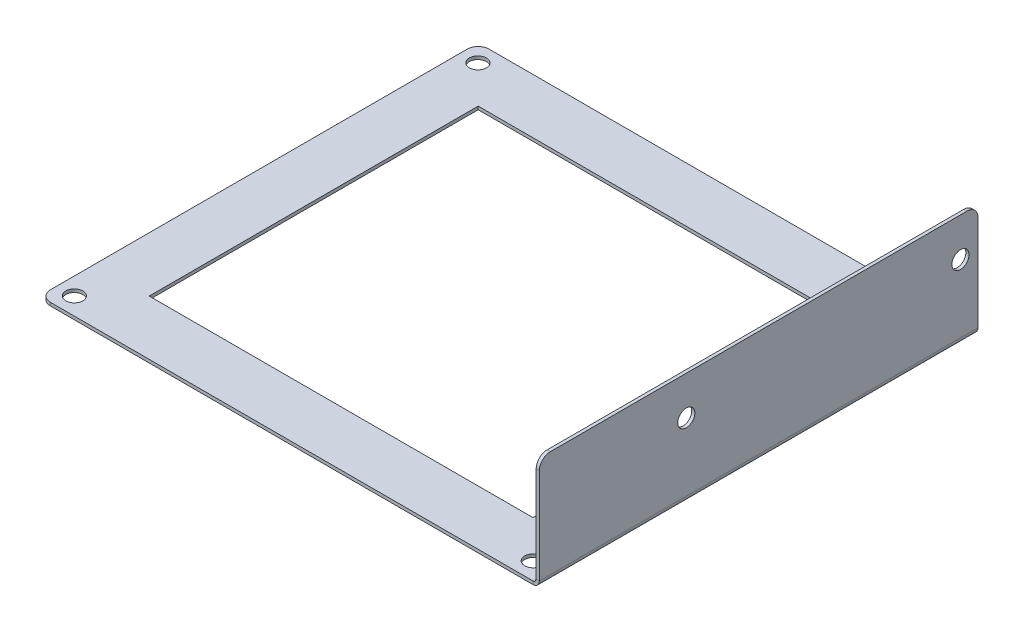
ISO-10303-21;
HEADER;
FILE_DESCRIPTION(('STEP AP214'),'2;1');
FILE_NAME('part.step','',(''),(''),'','','');
FILE_SCHEMA(('AUTOMOTIVE_DESIGN { 1 0 10303 214 1 1 1 1 }'));
ENDSEC;
DATA;
#1=APPLICATION_CONTEXT('core data for automotive mechanical design processes');
#2=APPLICATION_PROTOCOL_DEFINITION('international standard','automotive_design',2000,#1);
#3=PRODUCT_CONTEXT('',#1,'mechanical');
#4=PRODUCT('Part','Part','',(#3));
#5=PRODUCT_RELATED_PRODUCT_CATEGORY('part','',(#4));
#6=PRODUCT_DEFINITION_FORMATION('','',#4);
#7=PRODUCT_DEFINITION_CONTEXT('part definition',#1,'design');
#8=PRODUCT_DEFINITION('design','',#6,#7);
#9=PRODUCT_DEFINITION_SHAPE('','',#8);
#10=(LENGTH_UNIT() NAMED_UNIT(*) SI_UNIT(.MILLI.,.METRE.));
#11=(NAMED_UNIT(*) PLANE_ANGLE_UNIT() SI_UNIT($,.RADIAN.));
#12=(NAMED_UNIT(*) SI_UNIT($,.STERADIAN.) SOLID_ANGLE_UNIT());
#13=UNCERTAINTY_MEASURE_WITH_UNIT(LENGTH_MEASURE(1.E-05),#10,'distance_accuracy_value','');
#14=(GEOMETRIC_REPRESENTATION_CONTEXT(3) GLOBAL_UNCERTAINTY_ASSIGNED_CONTEXT((#13)) GLOBAL_UNIT_ASSIGNED_CONTEXT((#10,
#11,#12)) REPRESENTATION_CONTEXT('',''));
#15=CARTESIAN_POINT('',(0.,0.,0.));
#16=DIRECTION('',(0.,0.,1.));
#17=DIRECTION('',(1.,0.,0.));
#18=AXIS2_PLACEMENT_3D('',#15,#16,#17);
#19=CARTESIAN_POINT('',(-114.3,-0.7366,-101.6));
#20=DIRECTION('',(-1.,0.,0.));
#21=DIRECTION('',(0.,0.,1.));
#22=AXIS2_PLACEMENT_3D('',#19,#20,#21);
#23=PLANE('',#22);
#24=DIRECTION('',(0.,0.,1.));
#25=VECTOR('',#24,1.);
#26=CARTESIAN_POINT('',(-114.3,-0.7366,-101.6));
#27=LINE('',#26,#25);
#28=CARTESIAN_POINT('',(-114.3,-0.7366,-99.06));
#29=VERTEX_POINT('',#28);
#30=CARTESIAN_POINT('',(-114.3,-0.7366,-2.54));
#31=VERTEX_POINT('',#30);
#32=EDGE_CURVE('E288',#29,#31,#27,.T.);
#33=ORIENTED_EDGE('',*,*,#32,.T.);
#34=DIRECTION('',(0.,1.,0.));
#35=VECTOR('',#34,1.);
#36=CARTESIAN_POINT('',(-114.3,-0.7366,-2.54));
#37=LINE('',#36,#35);
#38=CARTESIAN_POINT('',(-114.3,0.,-2.54));
#39=VERTEX_POINT('',#38);
#40=EDGE_CURVE('E333',#31,#39,#37,.T.);
#41=ORIENTED_EDGE('',*,*,#40,.T.);
#42=DIRECTION('',(0.,0.,1.));
#43=VECTOR('',#42,1.);
#44=CARTESIAN_POINT('',(-114.3,0.,-101.6));
#45=LINE('',#44,#43);
#46=CARTESIAN_POINT('',(-114.3,0.,-99.06));
#47=VERTEX_POINT('',#46);
#48=EDGE_CURVE('E279',#47,#39,#45,.T.);
#49=ORIENTED_EDGE('',*,*,#48,.F.);
#50=DIRECTION('',(0.,1.,0.));
#51=VECTOR('',#50,1.);
#52=CARTESIAN_POINT('',(-114.3,-0.7366,-99.06));
#53=LINE('',#52,#51);
#54=EDGE_CURVE('E331',#47,#29,#53,.F.);
#55=ORIENTED_EDGE('',*,*,#54,.T.);
#56=EDGE_LOOP('',(#33,#41,#49,#55));
#57=FACE_BOUND('',#56,.T.);
#58=ADVANCED_FACE('F54',(#57),#23,.T.);
#59=CARTESIAN_POINT('',(-114.3,-0.7366,-101.6));
#60=DIRECTION('',(0.,0.,-1.));
#61=DIRECTION('',(-1.,0.,0.));
#62=AXIS2_PLACEMENT_3D('',#59,#60,#61);
#63=PLANE('',#62);
#64=DIRECTION('',(-1.,0.,0.));
#65=VECTOR('',#64,1.);
#66=CARTESIAN_POINT('',(-114.3,-0.7366,-101.6));
#67=LINE('',#66,#65);
#68=CARTESIAN_POINT('',(0.,-0.736599999999996,-101.6));
#69=VERTEX_POINT('',#68);
#70=CARTESIAN_POINT('',(-111.76,-0.7366,-101.6));
#71=VERTEX_POINT('',#70);
#72=EDGE_CURVE('E297',#69,#71,#67,.T.);
#73=ORIENTED_EDGE('',*,*,#72,.T.);
#74=DIRECTION('',(0.,1.,0.));
#75=VECTOR('',#74,1.);
#76=CARTESIAN_POINT('',(-111.76,-0.7366,-101.6));
#77=LINE('',#76,#75);
#78=CARTESIAN_POINT('',(-111.76,0.,-101.6));
#79=VERTEX_POINT('',#78);
#80=EDGE_CURVE('E13',#71,#79,#77,.T.);
#81=ORIENTED_EDGE('',*,*,#80,.T.);
#82=DIRECTION('',(-1.,0.,0.));
#83=VECTOR('',#82,1.);
#84=CARTESIAN_POINT('',(-114.3,0.,-101.6));
#85=LINE('',#84,#83);
#86=CARTESIAN_POINT('',(0.,0.,-101.6));
#87=VERTEX_POINT('',#86);
#88=EDGE_CURVE('E292',#87,#79,#85,.T.);
#89=ORIENTED_EDGE('',*,*,#88,.F.);
#90=DIRECTION('',(0.,1.,0.));
#91=VECTOR('',#90,1.);
#92=CARTESIAN_POINT('',(0.,-0.7366,-101.6));
#93=LINE('',#92,#91);
#94=EDGE_CURVE('E308',#69,#87,#93,.T.);
#95=ORIENTED_EDGE('',*,*,#94,.F.);
#96=EDGE_LOOP('',(#73,#81,#89,#95));
#97=FACE_BOUND('',#96,.T.);
#98=ADVANCED_FACE('F406',(#97),#63,.T.);
#99=CARTESIAN_POINT('',(-114.3,-0.7366,0.));
#100=DIRECTION('',(0.,0.,1.));
#101=DIRECTION('',(1.,0.,0.));
#102=AXIS2_PLACEMENT_3D('',#99,#100,#101);
#103=PLANE('',#102);
#104=DIRECTION('',(1.,0.,0.));
#105=VECTOR('',#104,1.);
#106=CARTESIAN_POINT('',(-114.3,0.,0.));
#107=LINE('',#106,#105);
#108=CARTESIAN_POINT('',(-111.76,0.,0.));
#109=VERTEX_POINT('',#108);
#110=CARTESIAN_POINT('',(0.,0.,0.));
#111=VERTEX_POINT('',#110);
#112=EDGE_CURVE('E302',#109,#111,#107,.T.);
#113=ORIENTED_EDGE('',*,*,#112,.F.);
#114=DIRECTION('',(0.,1.,0.));
#115=VECTOR('',#114,1.);
#116=CARTESIAN_POINT('',(-111.76,-0.7366,0.));
#117=LINE('',#116,#115);
#118=CARTESIAN_POINT('',(-111.76,-0.7366,0.));
#119=VERTEX_POINT('',#118);
#120=EDGE_CURVE('E77',#109,#119,#117,.F.);
#121=ORIENTED_EDGE('',*,*,#120,.T.);
#122=DIRECTION('',(1.,0.,0.));
#123=VECTOR('',#122,1.);
#124=CARTESIAN_POINT('',(-114.3,-0.7366,0.));
#125=LINE('',#124,#123);
#126=CARTESIAN_POINT('',(0.,-0.7366,0.));
#127=VERTEX_POINT('',#126);
#128=EDGE_CURVE('E291',#119,#127,#125,.T.);
#129=ORIENTED_EDGE('',*,*,#128,.T.);
#130=DIRECTION('',(0.,1.,0.));
#131=VECTOR('',#130,1.);
#132=CARTESIAN_POINT('',(0.,-0.7366,0.));
#133=LINE('',#132,#131);
#134=EDGE_CURVE('E299',#127,#111,#133,.T.);
#135=ORIENTED_EDGE('',*,*,#134,.T.);
#136=EDGE_LOOP('',(#113,#121,#129,#135));
#137=FACE_BOUND('',#136,.T.);
#138=ADVANCED_FACE('F351',(#137),#103,.T.);
#139=CARTESIAN_POINT('',(0.,-0.7366,0.));
#140=DIRECTION('',(0.,1.,0.));
#141=DIRECTION('',(0.,0.,1.));
#142=AXIS2_PLACEMENT_3D('',#139,#140,#141);
#143=PLANE('',#142);
#144=DIRECTION('',(1.,0.,0.));
#145=VECTOR('',#144,1.);
#146=CARTESIAN_POINT('',(-12.7,-0.7366,-12.7));
#147=LINE('',#146,#145);
#148=CARTESIAN_POINT('',(-101.6,-0.7366,-12.7));
#149=VERTEX_POINT('',#148);
#150=CARTESIAN_POINT('',(-12.7,-0.7366,-12.7));
#151=VERTEX_POINT('',#150);
#152=EDGE_CURVE('E181',#149,#151,#147,.T.);
#153=ORIENTED_EDGE('',*,*,#152,.T.);
#154=DIRECTION('',(0.,0.,-1.));
#155=VECTOR('',#154,1.);
#156=CARTESIAN_POINT('',(-12.7,-0.7366,-12.7));
#157=LINE('',#156,#155);
#158=CARTESIAN_POINT('',(-12.7,-0.7366,-88.9));
#159=VERTEX_POINT('',#158);
#160=EDGE_CURVE('E173',#151,#159,#157,.T.);
#161=ORIENTED_EDGE('',*,*,#160,.T.);
#162=DIRECTION('',(-1.,0.,0.));
#163=VECTOR('',#162,1.);
#164=CARTESIAN_POINT('',(-12.7,-0.7366,-88.9));
#165=LINE('',#164,#163);
#166=CARTESIAN_POINT('',(-101.6,-0.7366,-88.9));
#167=VERTEX_POINT('',#166);
#168=EDGE_CURVE('E185',#159,#167,#165,.T.);
#169=ORIENTED_EDGE('',*,*,#168,.T.);
#170=DIRECTION('',(0.,0.,1.));
#171=VECTOR('',#170,1.);
#172=CARTESIAN_POINT('',(-101.6,-0.7366,-12.7));
#173=LINE('',#172,#171);
#174=EDGE_CURVE('E189',#167,#149,#173,.T.);
#175=ORIENTED_EDGE('',*,*,#174,.T.);
#176=EDGE_LOOP('',(#153,#161,#169,#175));
#177=FACE_BOUND('',#176,.T.);
#178=CARTESIAN_POINT('',(-110.2995,-0.7366,-4.06400000000001));
#179=DIRECTION('',(0.,1.,0.));
#180=DIRECTION('',(0.,0.,1.));
#181=AXIS2_PLACEMENT_3D('',#178,#179,#180);
#182=CIRCLE('',#181,1.984375);
#183=CARTESIAN_POINT('',(-110.2995,-0.7366,-2.07962500000002));
#184=VERTEX_POINT('',#183);
#185=EDGE_CURVE('E227',#184,#184,#182,.T.);
#186=ORIENTED_EDGE('',*,*,#185,.T.);
#187=EDGE_LOOP('',(#186));
#188=FACE_BOUND('',#187,.T.);
#189=CARTESIAN_POINT('',(-110.2995,-0.7366,-97.536));
#190=DIRECTION('',(0.,1.,0.));
#191=DIRECTION('',(0.,0.,1.));
#192=AXIS2_PLACEMENT_3D('',#189,#190,#191);
#193=CIRCLE('',#192,1.984375);
#194=CARTESIAN_POINT('',(-110.2995,-0.7366,-95.551625));
#195=VERTEX_POINT('',#194);
#196=EDGE_CURVE('E233',#195,#195,#193,.T.);
#197=ORIENTED_EDGE('',*,*,#196,.T.);
#198=EDGE_LOOP('',(#197));
#199=FACE_BOUND('',#198,.T.);
#200=CARTESIAN_POINT('',(-4.00050000000001,-0.7366,-97.536));
#201=DIRECTION('',(0.,1.,0.));
#202=DIRECTION('',(0.,0.,1.));
#203=AXIS2_PLACEMENT_3D('',#200,#201,#202);
#204=CIRCLE('',#203,1.984375);
#205=CARTESIAN_POINT('',(-4.00050000000001,-0.7366,-95.551625));
#206=VERTEX_POINT('',#205);
#207=EDGE_CURVE('E239',#206,#206,#204,.T.);
#208=ORIENTED_EDGE('',*,*,#207,.T.);
#209=EDGE_LOOP('',(#208));
#210=FACE_BOUND('',#209,.T.);
#211=CARTESIAN_POINT('',(-4.00050000000001,-0.7366,-4.06400000000001));
#212=DIRECTION('',(0.,1.,0.));
#213=DIRECTION('',(0.,0.,1.));
#214=AXIS2_PLACEMENT_3D('',#211,#212,#213);
#215=CIRCLE('',#214,1.984375);
#216=CARTESIAN_POINT('',(-4.00050000000001,-0.7366,-2.07962500000001));
#217=VERTEX_POINT('',#216);
#218=EDGE_CURVE('E245',#217,#217,#215,.T.);
#219=ORIENTED_EDGE('',*,*,#218,.T.);
#220=EDGE_LOOP('',(#219));
#221=FACE_BOUND('',#220,.T.);
#222=ORIENTED_EDGE('',*,*,#128,.F.);
#223=CARTESIAN_POINT('',(-111.76,-0.7366,-2.54));
#224=DIRECTION('',(0.,1.,0.));
#225=DIRECTION('',(0.,0.,1.));
#226=AXIS2_PLACEMENT_3D('',#223,#224,#225);
#227=CIRCLE('',#226,2.54);
#228=EDGE_CURVE('E62',#119,#31,#227,.F.);
#229=ORIENTED_EDGE('',*,*,#228,.T.);
#230=ORIENTED_EDGE('',*,*,#32,.F.);
#231=CARTESIAN_POINT('',(-111.76,-0.7366,-99.06));
#232=DIRECTION('',(0.,1.,0.));
#233=DIRECTION('',(0.,0.,1.));
#234=AXIS2_PLACEMENT_3D('',#231,#232,#233);
#235=CIRCLE('',#234,2.54);
#236=EDGE_CURVE('E69',#29,#71,#235,.F.);
#237=ORIENTED_EDGE('',*,*,#236,.T.);
#238=ORIENTED_EDGE('',*,*,#72,.F.);
#239=DIRECTION('',(0.,0.,-1.));
#240=VECTOR('',#239,1.);
#241=CARTESIAN_POINT('',(0.,-0.7366,-101.6));
#242=LINE('',#241,#240);
#243=EDGE_CURVE('E294',#127,#69,#242,.T.);
#244=ORIENTED_EDGE('',*,*,#243,.F.);
#245=EDGE_LOOP('',(#222,#229,#230,#237,#238,#244));
#246=FACE_BOUND('',#245,.T.);
#247=ADVANCED_FACE('F191',(#177,#188,#199,#210,#221,#246),#143,.F.);
#248=CARTESIAN_POINT('',(0.,0.,0.));
#249=DIRECTION('',(0.,1.,0.));
#250=DIRECTION('',(0.,0.,1.));
#251=AXIS2_PLACEMENT_3D('',#248,#249,#250);
#252=PLANE('',#251);
#253=DIRECTION('',(0.,0.,-1.));
#254=VECTOR('',#253,1.);
#255=CARTESIAN_POINT('',(-12.7,0.,-12.7));
#256=LINE('',#255,#254);
#257=CARTESIAN_POINT('',(-12.7,0.,-12.7));
#258=VERTEX_POINT('',#257);
#259=CARTESIAN_POINT('',(-12.7,0.,-88.9));
#260=VERTEX_POINT('',#259);
#261=EDGE_CURVE('E176',#258,#260,#256,.T.);
#262=ORIENTED_EDGE('',*,*,#261,.F.);
#263=DIRECTION('',(1.,0.,0.));
#264=VECTOR('',#263,1.);
#265=CARTESIAN_POINT('',(-12.7,0.,-12.7));
#266=LINE('',#265,#264);
#267=CARTESIAN_POINT('',(-101.6,0.,-12.7));
#268=VERTEX_POINT('',#267);
#269=EDGE_CURVE('E194',#268,#258,#266,.T.);
#270=ORIENTED_EDGE('',*,*,#269,.F.);
#271=DIRECTION('',(0.,0.,1.));
#272=VECTOR('',#271,1.);
#273=CARTESIAN_POINT('',(-101.6,0.,-12.7));
#274=LINE('',#273,#272);
#275=CARTESIAN_POINT('',(-101.6,0.,-88.9));
#276=VERTEX_POINT('',#275);
#277=EDGE_CURVE('E197',#276,#268,#274,.T.);
#278=ORIENTED_EDGE('',*,*,#277,.F.);
#279=DIRECTION('',(-1.,0.,0.));
#280=VECTOR('',#279,1.);
#281=CARTESIAN_POINT('',(-12.7,0.,-88.9));
#282=LINE('',#281,#280);
#283=EDGE_CURVE('E203',#260,#276,#282,.T.);
#284=ORIENTED_EDGE('',*,*,#283,.F.);
#285=EDGE_LOOP('',(#262,#270,#278,#284));
#286=FACE_BOUND('',#285,.T.);
#287=CARTESIAN_POINT('',(-110.2995,0.,-4.06400000000001));
#288=DIRECTION('',(0.,1.,0.));
#289=DIRECTION('',(0.,0.,1.));
#290=AXIS2_PLACEMENT_3D('',#287,#288,#289);
#291=CIRCLE('',#290,1.98437499999998);
#292=CARTESIAN_POINT('',(-110.2995,0.,-2.07962500000003));
#293=VERTEX_POINT('',#292);
#294=EDGE_CURVE('E224',#293,#293,#291,.T.);
#295=ORIENTED_EDGE('',*,*,#294,.F.);
#296=EDGE_LOOP('',(#295));
#297=FACE_BOUND('',#296,.T.);
#298=CARTESIAN_POINT('',(-110.2995,0.,-97.536));
#299=DIRECTION('',(0.,1.,0.));
#300=DIRECTION('',(0.,0.,1.));
#301=AXIS2_PLACEMENT_3D('',#298,#299,#300);
#302=CIRCLE('',#301,1.98437499999998);
#303=CARTESIAN_POINT('',(-110.2995,0.,-95.551625));
#304=VERTEX_POINT('',#303);
#305=EDGE_CURVE('E230',#304,#304,#302,.T.);
#306=ORIENTED_EDGE('',*,*,#305,.F.);
#307=EDGE_LOOP('',(#306));
#308=FACE_BOUND('',#307,.T.);
#309=CARTESIAN_POINT('',(-4.00050000000001,0.,-97.536));
#310=DIRECTION('',(0.,1.,0.));
#311=DIRECTION('',(0.,0.,1.));
#312=AXIS2_PLACEMENT_3D('',#309,#310,#311);
#313=CIRCLE('',#312,1.98437499999999);
#314=CARTESIAN_POINT('',(-4.00050000000001,0.,-95.551625));
#315=VERTEX_POINT('',#314);
#316=EDGE_CURVE('E236',#315,#315,#313,.T.);
#317=ORIENTED_EDGE('',*,*,#316,.F.);
#318=EDGE_LOOP('',(#317));
#319=FACE_BOUND('',#318,.T.);
#320=CARTESIAN_POINT('',(-4.00050000000001,0.,-4.06400000000001));
#321=DIRECTION('',(0.,1.,0.));
#322=DIRECTION('',(0.,0.,1.));
#323=AXIS2_PLACEMENT_3D('',#320,#321,#322);
#324=CIRCLE('',#323,1.98437499999999);
#325=CARTESIAN_POINT('',(-4.00050000000001,0.,-2.07962500000002));
#326=VERTEX_POINT('',#325);
#327=EDGE_CURVE('E242',#326,#326,#324,.T.);
#328=ORIENTED_EDGE('',*,*,#327,.F.);
#329=EDGE_LOOP('',(#328));
#330=FACE_BOUND('',#329,.T.);
#331=ORIENTED_EDGE('',*,*,#48,.T.);
#332=CARTESIAN_POINT('',(-111.76,0.,-2.54));
#333=DIRECTION('',(0.,1.,0.));
#334=DIRECTION('',(0.,0.,1.));
#335=AXIS2_PLACEMENT_3D('',#332,#333,#334);
#336=CIRCLE('',#335,2.54);
#337=EDGE_CURVE('E338',#39,#109,#336,.T.);
#338=ORIENTED_EDGE('',*,*,#337,.T.);
#339=ORIENTED_EDGE('',*,*,#112,.T.);
#340=DIRECTION('',(0.,0.,-1.));
#341=VECTOR('',#340,1.);
#342=CARTESIAN_POINT('',(0.,0.,-101.6));
#343=LINE('',#342,#341);
#344=EDGE_CURVE('E304',#111,#87,#343,.T.);
#345=ORIENTED_EDGE('',*,*,#344,.T.);
#346=ORIENTED_EDGE('',*,*,#88,.T.);
#347=CARTESIAN_POINT('',(-111.76,0.,-99.06));
#348=DIRECTION('',(0.,1.,0.));
#349=DIRECTION('',(0.,0.,1.));
#350=AXIS2_PLACEMENT_3D('',#347,#348,#349);
#351=CIRCLE('',#350,2.54);
#352=EDGE_CURVE('E336',#79,#47,#351,.T.);
#353=ORIENTED_EDGE('',*,*,#352,.T.);
#354=EDGE_LOOP('',(#331,#338,#339,#345,#346,#353));
#355=FACE_BOUND('',#354,.T.);
#356=ADVANCED_FACE('F350',(#286,#297,#308,#319,#330,#355),#252,.T.);
#357=CARTESIAN_POINT('',(0.,0.7366,0.));
#358=DIRECTION('',(0.,0.,1.));
#359=DIRECTION('',(1.,0.,0.));
#360=AXIS2_PLACEMENT_3D('',#357,#358,#359);
#361=PLANE('',#360);
#362=DIRECTION('',(-1.,0.,0.));
#363=VECTOR('',#362,1.);
#364=CARTESIAN_POINT('',(1.4732,0.736599999999995,0.));
#365=LINE('',#364,#363);
#366=CARTESIAN_POINT('',(0.7366,0.736599999999997,0.));
#367=VERTEX_POINT('',#366);
#368=CARTESIAN_POINT('',(1.4732,0.736599999999995,0.));
#369=VERTEX_POINT('',#368);
#370=EDGE_CURVE('E248',#367,#369,#365,.F.);
#371=ORIENTED_EDGE('',*,*,#370,.F.);
#372=CARTESIAN_POINT('',(0.,0.7366,0.));
#373=DIRECTION('',(0.,0.,-1.));
#374=DIRECTION('',(-1.,0.,0.));
#375=AXIS2_PLACEMENT_3D('',#372,#373,#374);
#376=CIRCLE('',#375,0.736599999999996);
#377=EDGE_CURVE('E283',#111,#367,#376,.F.);
#378=ORIENTED_EDGE('',*,*,#377,.F.);
#379=ORIENTED_EDGE('',*,*,#134,.F.);
#380=CARTESIAN_POINT('',(0.,0.7366,0.));
#381=DIRECTION('',(0.,0.,-1.));
#382=DIRECTION('',(-1.,0.,0.));
#383=AXIS2_PLACEMENT_3D('',#380,#381,#382);
#384=CIRCLE('',#383,1.4732);
#385=EDGE_CURVE('E276',#127,#369,#384,.F.);
#386=ORIENTED_EDGE('',*,*,#385,.T.);
#387=EDGE_LOOP('',(#371,#378,#379,#386));
#388=FACE_BOUND('',#387,.T.);
#389=ADVANCED_FACE('F363',(#388),#361,.T.);
#390=CARTESIAN_POINT('',(0.,0.7366,-101.6));
#391=DIRECTION('',(0.,0.,1.));
#392=DIRECTION('',(1.,0.,0.));
#393=AXIS2_PLACEMENT_3D('',#390,#391,#392);
#394=PLANE('',#393);
#395=CARTESIAN_POINT('',(0.,0.7366,-101.6));
#396=DIRECTION('',(0.,0.,-1.));
#397=DIRECTION('',(-1.,0.,0.));
#398=AXIS2_PLACEMENT_3D('',#395,#396,#397);
#399=CIRCLE('',#398,0.736599999999996);
#400=CARTESIAN_POINT('',(0.736599999999992,0.736599999999997,-101.6));
#401=VERTEX_POINT('',#400);
#402=EDGE_CURVE('E251',#401,#87,#399,.T.);
#403=ORIENTED_EDGE('',*,*,#402,.F.);
#404=DIRECTION('',(-1.,0.,0.));
#405=VECTOR('',#404,1.);
#406=CARTESIAN_POINT('',(0.7366,0.736599999999997,-101.6));
#407=LINE('',#406,#405);
#408=CARTESIAN_POINT('',(1.4732,0.736599999999995,-101.6));
#409=VERTEX_POINT('',#408);
#410=EDGE_CURVE('E269',#401,#409,#407,.F.);
#411=ORIENTED_EDGE('',*,*,#410,.T.);
#412=CARTESIAN_POINT('',(0.,0.7366,-101.6));
#413=DIRECTION('',(0.,0.,-1.));
#414=DIRECTION('',(-1.,0.,0.));
#415=AXIS2_PLACEMENT_3D('',#412,#413,#414);
#416=CIRCLE('',#415,1.4732);
#417=EDGE_CURVE('E280',#409,#69,#416,.T.);
#418=ORIENTED_EDGE('',*,*,#417,.T.);
#419=ORIENTED_EDGE('',*,*,#94,.T.);
#420=EDGE_LOOP('',(#403,#411,#418,#419));
#421=FACE_BOUND('',#420,.T.);
#422=ADVANCED_FACE('F375',(#421),#394,.F.);
#423=CARTESIAN_POINT('',(0.,0.7366,-101.6));
#424=DIRECTION('',(0.,0.,-1.));
#425=DIRECTION('',(1.,0.,0.));
#426=AXIS2_PLACEMENT_3D('',#423,#424,#425);
#427=CYLINDRICAL_SURFACE('',#426,1.4732);
#428=ORIENTED_EDGE('',*,*,#243,.T.);
#429=ORIENTED_EDGE('',*,*,#417,.F.);
#430=DIRECTION('',(0.,0.,-1.));
#431=VECTOR('',#430,1.);
#432=CARTESIAN_POINT('',(1.4732,0.736599999999995,0.));
#433=LINE('',#432,#431);
#434=EDGE_CURVE('E266',#409,#369,#433,.F.);
#435=ORIENTED_EDGE('',*,*,#434,.T.);
#436=ORIENTED_EDGE('',*,*,#385,.F.);
#437=EDGE_LOOP('',(#428,#429,#435,#436));
#438=FACE_BOUND('',#437,.T.);
#439=ADVANCED_FACE('F422',(#438),#427,.T.);
#440=CARTESIAN_POINT('',(0.,0.7366,-101.6));
#441=DIRECTION('',(0.,0.,-1.));
#442=DIRECTION('',(1.,0.,0.));
#443=AXIS2_PLACEMENT_3D('',#440,#441,#442);
#444=CYLINDRICAL_SURFACE('',#443,0.736599999999996);
#445=ORIENTED_EDGE('',*,*,#344,.F.);
#446=ORIENTED_EDGE('',*,*,#377,.T.);
#447=DIRECTION('',(0.,0.,-1.));
#448=VECTOR('',#447,1.);
#449=CARTESIAN_POINT('',(0.7366,0.736599999999997,0.));
#450=LINE('',#449,#448);
#451=EDGE_CURVE('E272',#367,#401,#450,.T.);
#452=ORIENTED_EDGE('',*,*,#451,.T.);
#453=ORIENTED_EDGE('',*,*,#402,.T.);
#454=EDGE_LOOP('',(#445,#446,#452,#453));
#455=FACE_BOUND('',#454,.T.);
#456=ADVANCED_FACE('F358',(#455),#444,.F.);
#457=CARTESIAN_POINT('',(1.47320000000009,25.4,-101.6));
#458=DIRECTION('',(0.,0.,1.));
#459=DIRECTION('',(1.,0.,0.));
#460=AXIS2_PLACEMENT_3D('',#457,#458,#459);
#461=PLANE('',#460);
#462=DIRECTION('',(0.,-1.,0.));
#463=VECTOR('',#462,1.);
#464=CARTESIAN_POINT('',(0.736600000000086,25.4,-101.6));
#465=LINE('',#464,#463);
#466=CARTESIAN_POINT('',(0.736600000000077,22.86,-101.6));
#467=VERTEX_POINT('',#466);
#468=EDGE_CURVE('E263',#401,#467,#465,.F.);
#469=ORIENTED_EDGE('',*,*,#468,.T.);
#470=DIRECTION('',(-1.,0.,0.));
#471=VECTOR('',#470,1.);
#472=CARTESIAN_POINT('',(1.47320000000008,22.86,-101.6));
#473=LINE('',#472,#471);
#474=CARTESIAN_POINT('',(1.47320000000008,22.86,-101.6));
#475=VERTEX_POINT('',#474);
#476=EDGE_CURVE('E329',#467,#475,#473,.F.);
#477=ORIENTED_EDGE('',*,*,#476,.T.);
#478=DIRECTION('',(0.,1.,0.));
#479=VECTOR('',#478,1.);
#480=CARTESIAN_POINT('',(1.4732,0.,-101.6));
#481=LINE('',#480,#479);
#482=EDGE_CURVE('E255',#409,#475,#481,.T.);
#483=ORIENTED_EDGE('',*,*,#482,.F.);
#484=ORIENTED_EDGE('',*,*,#410,.F.);
#485=EDGE_LOOP('',(#469,#477,#483,#484));
#486=FACE_BOUND('',#485,.T.);
#487=ADVANCED_FACE('F380',(#486),#461,.F.);
#488=CARTESIAN_POINT('',(1.4732,0.,0.));
#489=DIRECTION('',(0.,0.,-1.));
#490=DIRECTION('',(0.,1.,0.));
#491=AXIS2_PLACEMENT_3D('',#488,#489,#490);
#492=PLANE('',#491);
#493=DIRECTION('',(0.,-1.,0.));
#494=VECTOR('',#493,1.);
#495=CARTESIAN_POINT('',(1.4732,0.,0.));
#496=LINE('',#495,#494);
#497=CARTESIAN_POINT('',(1.47320000000008,22.86,0.));
#498=VERTEX_POINT('',#497);
#499=EDGE_CURVE('E249',#498,#369,#496,.T.);
#500=ORIENTED_EDGE('',*,*,#499,.F.);
#501=DIRECTION('',(-1.,0.,0.));
#502=VECTOR('',#501,1.);
#503=CARTESIAN_POINT('',(1.47320000000008,22.86,0.));
#504=LINE('',#503,#502);
#505=CARTESIAN_POINT('',(0.736600000000077,22.86,0.));
#506=VERTEX_POINT('',#505);
#507=EDGE_CURVE('E311',#498,#506,#504,.T.);
#508=ORIENTED_EDGE('',*,*,#507,.T.);
#509=DIRECTION('',(0.,1.,0.));
#510=VECTOR('',#509,1.);
#511=CARTESIAN_POINT('',(0.736599999999997,0.,0.));
#512=LINE('',#511,#510);
#513=EDGE_CURVE('E258',#506,#367,#512,.F.);
#514=ORIENTED_EDGE('',*,*,#513,.T.);
#515=ORIENTED_EDGE('',*,*,#370,.T.);
#516=EDGE_LOOP('',(#500,#508,#514,#515));
#517=FACE_BOUND('',#516,.T.);
#518=ADVANCED_FACE('F366',(#517),#492,.F.);
#519=CARTESIAN_POINT('',(1.4732,0.,0.));
#520=DIRECTION('',(-1.,0.,0.));
#521=DIRECTION('',(0.,-1.,0.));
#522=AXIS2_PLACEMENT_3D('',#519,#520,#521);
#523=PLANE('',#522);
#524=CARTESIAN_POINT('',(1.4732000000001,16.4360618686601,-34.036));
#525=DIRECTION('',(-1.,0.,0.));
#526=DIRECTION('',(0.,0.,1.));
#527=AXIS2_PLACEMENT_3D('',#524,#525,#526);
#528=CIRCLE('',#527,1.984375);
#529=CARTESIAN_POINT('',(1.4732000000001,16.4360618686601,-32.051625));
#530=VERTEX_POINT('',#529);
#531=EDGE_CURVE('E215',#530,#530,#528,.T.);
#532=ORIENTED_EDGE('',*,*,#531,.T.);
#533=EDGE_LOOP('',(#532));
#534=FACE_BOUND('',#533,.T.);
#535=CARTESIAN_POINT('',(1.4732000000001,16.4360618686601,-97.536));
#536=DIRECTION('',(-1.,0.,0.));
#537=DIRECTION('',(0.,0.,1.));
#538=AXIS2_PLACEMENT_3D('',#535,#536,#537);
#539=CIRCLE('',#538,1.984375);
#540=CARTESIAN_POINT('',(1.4732000000001,16.4360618686601,-95.551625));
#541=VERTEX_POINT('',#540);
#542=EDGE_CURVE('E221',#541,#541,#539,.T.);
#543=ORIENTED_EDGE('',*,*,#542,.T.);
#544=EDGE_LOOP('',(#543));
#545=FACE_BOUND('',#544,.T.);
#546=DIRECTION('',(0.,0.,1.));
#547=VECTOR('',#546,1.);
#548=CARTESIAN_POINT('',(1.47320000000009,25.4,0.));
#549=LINE('',#548,#547);
#550=CARTESIAN_POINT('',(1.47320000000009,25.4,-99.06));
#551=VERTEX_POINT('',#550);
#552=CARTESIAN_POINT('',(1.47320000000009,25.4,-2.54));
#553=VERTEX_POINT('',#552);
#554=EDGE_CURVE('E252',#551,#553,#549,.T.);
#555=ORIENTED_EDGE('',*,*,#554,.T.);
#556=CARTESIAN_POINT('',(1.47320000000008,22.86,-2.54));
#557=DIRECTION('',(-1.,0.,0.));
#558=DIRECTION('',(0.,-1.,0.));
#559=AXIS2_PLACEMENT_3D('',#556,#557,#558);
#560=CIRCLE('',#559,2.54);
#561=EDGE_CURVE('E327',#553,#498,#560,.F.);
#562=ORIENTED_EDGE('',*,*,#561,.T.);
#563=ORIENTED_EDGE('',*,*,#499,.T.);
#564=ORIENTED_EDGE('',*,*,#434,.F.);
#565=ORIENTED_EDGE('',*,*,#482,.T.);
#566=CARTESIAN_POINT('',(1.47320000000008,22.86,-99.06));
#567=DIRECTION('',(-1.,0.,0.));
#568=DIRECTION('',(0.,-1.,0.));
#569=AXIS2_PLACEMENT_3D('',#566,#567,#568);
#570=CIRCLE('',#569,2.54);
#571=EDGE_CURVE('E325',#475,#551,#570,.F.);
#572=ORIENTED_EDGE('',*,*,#571,.T.);
#573=EDGE_LOOP('',(#555,#562,#563,#564,#565,#572));
#574=FACE_BOUND('',#573,.T.);
#575=ADVANCED_FACE('F384',(#534,#545,#574),#523,.F.);
#576=CARTESIAN_POINT('',(0.736599999999997,0.,0.));
#577=DIRECTION('',(-1.,0.,0.));
#578=DIRECTION('',(0.,-1.,0.));
#579=AXIS2_PLACEMENT_3D('',#576,#577,#578);
#580=PLANE('',#579);
#581=CARTESIAN_POINT('',(0.736600000000053,16.4360618686601,-34.036));
#582=DIRECTION('',(-1.,0.,0.));
#583=DIRECTION('',(0.,0.,1.));
#584=AXIS2_PLACEMENT_3D('',#581,#582,#583);
#585=CIRCLE('',#584,1.98437499999999);
#586=CARTESIAN_POINT('',(0.736600000000053,16.4360618686601,-32.051625));
#587=VERTEX_POINT('',#586);
#588=EDGE_CURVE('E209',#587,#587,#585,.T.);
#589=ORIENTED_EDGE('',*,*,#588,.F.);
#590=EDGE_LOOP('',(#589));
#591=FACE_BOUND('',#590,.T.);
#592=CARTESIAN_POINT('',(0.736600000000053,16.4360618686601,-97.536));
#593=DIRECTION('',(-1.,0.,0.));
#594=DIRECTION('',(0.,0.,1.));
#595=AXIS2_PLACEMENT_3D('',#592,#593,#594);
#596=CIRCLE('',#595,1.98437499999999);
#597=CARTESIAN_POINT('',(0.736600000000053,16.4360618686601,-95.551625));
#598=VERTEX_POINT('',#597);
#599=EDGE_CURVE('E218',#598,#598,#596,.T.);
#600=ORIENTED_EDGE('',*,*,#599,.F.);
#601=EDGE_LOOP('',(#600));
#602=FACE_BOUND('',#601,.T.);
#603=ORIENTED_EDGE('',*,*,#513,.F.);
#604=CARTESIAN_POINT('',(0.736600000000077,22.86,-2.54));
#605=DIRECTION('',(-1.,0.,0.));
#606=DIRECTION('',(0.,-1.,0.));
#607=AXIS2_PLACEMENT_3D('',#604,#605,#606);
#608=CIRCLE('',#607,2.54);
#609=CARTESIAN_POINT('',(0.736600000000086,25.4,-2.54));
#610=VERTEX_POINT('',#609);
#611=EDGE_CURVE('E318',#506,#610,#608,.T.);
#612=ORIENTED_EDGE('',*,*,#611,.T.);
#613=DIRECTION('',(0.,0.,-1.));
#614=VECTOR('',#613,1.);
#615=CARTESIAN_POINT('',(0.736600000000086,25.4,0.));
#616=LINE('',#615,#614);
#617=CARTESIAN_POINT('',(0.736600000000086,25.4,-99.06));
#618=VERTEX_POINT('',#617);
#619=EDGE_CURVE('E260',#618,#610,#616,.F.);
#620=ORIENTED_EDGE('',*,*,#619,.F.);
#621=CARTESIAN_POINT('',(0.736600000000077,22.86,-99.06));
#622=DIRECTION('',(-1.,0.,0.));
#623=DIRECTION('',(0.,-1.,0.));
#624=AXIS2_PLACEMENT_3D('',#621,#622,#623);
#625=CIRCLE('',#624,2.54);
#626=EDGE_CURVE('E316',#618,#467,#625,.T.);
#627=ORIENTED_EDGE('',*,*,#626,.T.);
#628=ORIENTED_EDGE('',*,*,#468,.F.);
#629=ORIENTED_EDGE('',*,*,#451,.F.);
#630=EDGE_LOOP('',(#603,#612,#620,#627,#628,#629));
#631=FACE_BOUND('',#630,.T.);
#632=ADVANCED_FACE('F370',(#591,#602,#631),#580,.T.);
#633=CARTESIAN_POINT('',(1.47320000000009,25.4,0.));
#634=DIRECTION('',(0.,-1.,0.));
#635=DIRECTION('',(1.,0.,0.));
#636=AXIS2_PLACEMENT_3D('',#633,#634,#635);
#637=PLANE('',#636);
#638=ORIENTED_EDGE('',*,*,#619,.T.);
#639=DIRECTION('',(-1.,0.,0.));
#640=VECTOR('',#639,1.);
#641=CARTESIAN_POINT('',(1.47320000000009,25.4,-2.54));
#642=LINE('',#641,#640);
#643=EDGE_CURVE('E323',#610,#553,#642,.F.);
#644=ORIENTED_EDGE('',*,*,#643,.T.);
#645=ORIENTED_EDGE('',*,*,#554,.F.);
#646=DIRECTION('',(-1.,0.,0.));
#647=VECTOR('',#646,1.);
#648=CARTESIAN_POINT('',(1.47320000000009,25.4,-99.06));
#649=LINE('',#648,#647);
#650=EDGE_CURVE('E320',#551,#618,#649,.T.);
#651=ORIENTED_EDGE('',*,*,#650,.T.);
#652=EDGE_LOOP('',(#638,#644,#645,#651));
#653=FACE_BOUND('',#652,.T.);
#654=ADVANCED_FACE('F390',(#653),#637,.F.);
#655=CARTESIAN_POINT('',(-4.00050000000001,0.,-4.06400000000001));
#656=DIRECTION('',(0.,1.,0.));
#657=DIRECTION('',(0.,0.,1.));
#658=AXIS2_PLACEMENT_3D('',#655,#656,#657);
#659=CYLINDRICAL_SURFACE('',#658,1.98437499999999);
#660=ORIENTED_EDGE('',*,*,#218,.F.);
#661=EDGE_LOOP('',(#660));
#662=FACE_BOUND('',#661,.T.);
#663=ORIENTED_EDGE('',*,*,#327,.T.);
#664=EDGE_LOOP('',(#663));
#665=FACE_BOUND('',#664,.T.);
#666=ADVANCED_FACE('F434',(#662,#665),#659,.F.);
#667=CARTESIAN_POINT('',(-4.00050000000001,0.,-97.536));
#668=DIRECTION('',(0.,1.,0.));
#669=DIRECTION('',(0.,0.,1.));
#670=AXIS2_PLACEMENT_3D('',#667,#668,#669);
#671=CYLINDRICAL_SURFACE('',#670,1.98437499999999);
#672=ORIENTED_EDGE('',*,*,#207,.F.);
#673=EDGE_LOOP('',(#672));
#674=FACE_BOUND('',#673,.T.);
#675=ORIENTED_EDGE('',*,*,#316,.T.);
#676=EDGE_LOOP('',(#675));
#677=FACE_BOUND('',#676,.T.);
#678=ADVANCED_FACE('F445',(#674,#677),#671,.F.);
#679=CARTESIAN_POINT('',(-110.2995,0.,-97.536));
#680=DIRECTION('',(0.,1.,0.));
#681=DIRECTION('',(0.,0.,1.));
#682=AXIS2_PLACEMENT_3D('',#679,#680,#681);
#683=CYLINDRICAL_SURFACE('',#682,1.98437499999999);
#684=ORIENTED_EDGE('',*,*,#196,.F.);
#685=EDGE_LOOP('',(#684));
#686=FACE_BOUND('',#685,.T.);
#687=ORIENTED_EDGE('',*,*,#305,.T.);
#688=EDGE_LOOP('',(#687));
#689=FACE_BOUND('',#688,.T.);
#690=ADVANCED_FACE('F449',(#686,#689),#683,.F.);
#691=CARTESIAN_POINT('',(-110.2995,0.,-4.06400000000001));
#692=DIRECTION('',(0.,1.,0.));
#693=DIRECTION('',(0.,0.,1.));
#694=AXIS2_PLACEMENT_3D('',#691,#692,#693);
#695=CYLINDRICAL_SURFACE('',#694,1.98437499999999);
#696=ORIENTED_EDGE('',*,*,#185,.F.);
#697=EDGE_LOOP('',(#696));
#698=FACE_BOUND('',#697,.T.);
#699=ORIENTED_EDGE('',*,*,#294,.T.);
#700=EDGE_LOOP('',(#699));
#701=FACE_BOUND('',#700,.T.);
#702=ADVANCED_FACE('F453',(#698,#701),#695,.F.);
#703=CARTESIAN_POINT('',(0.736600000000055,16.4360618686601,-97.536));
#704=DIRECTION('',(-1.,0.,0.));
#705=DIRECTION('',(0.,0.,1.));
#706=AXIS2_PLACEMENT_3D('',#703,#704,#705);
#707=CYLINDRICAL_SURFACE('',#706,1.98437499999999);
#708=ORIENTED_EDGE('',*,*,#542,.F.);
#709=EDGE_LOOP('',(#708));
#710=FACE_BOUND('',#709,.T.);
#711=ORIENTED_EDGE('',*,*,#599,.T.);
#712=EDGE_LOOP('',(#711));
#713=FACE_BOUND('',#712,.T.);
#714=ADVANCED_FACE('F457',(#710,#713),#707,.F.);
#715=CARTESIAN_POINT('',(0.736600000000055,16.4360618686601,-34.036));
#716=DIRECTION('',(-1.,0.,0.));
#717=DIRECTION('',(0.,0.,1.));
#718=AXIS2_PLACEMENT_3D('',#715,#716,#717);
#719=CYLINDRICAL_SURFACE('',#718,1.98437499999999);
#720=ORIENTED_EDGE('',*,*,#531,.F.);
#721=EDGE_LOOP('',(#720));
#722=FACE_BOUND('',#721,.T.);
#723=ORIENTED_EDGE('',*,*,#588,.T.);
#724=EDGE_LOOP('',(#723));
#725=FACE_BOUND('',#724,.T.);
#726=ADVANCED_FACE('F461',(#722,#725),#719,.F.);
#727=CARTESIAN_POINT('',(-12.7,-0.7366,-12.7));
#728=DIRECTION('',(1.,0.,0.));
#729=DIRECTION('',(0.,0.,-1.));
#730=AXIS2_PLACEMENT_3D('',#727,#728,#729);
#731=PLANE('',#730);
#732=ORIENTED_EDGE('',*,*,#261,.T.);
#733=DIRECTION('',(0.,1.,0.));
#734=VECTOR('',#733,1.);
#735=CARTESIAN_POINT('',(-12.7,-0.7366,-88.9));
#736=LINE('',#735,#734);
#737=EDGE_CURVE('E169',#159,#260,#736,.T.);
#738=ORIENTED_EDGE('',*,*,#737,.F.);
#739=ORIENTED_EDGE('',*,*,#160,.F.);
#740=DIRECTION('',(0.,1.,0.));
#741=VECTOR('',#740,1.);
#742=CARTESIAN_POINT('',(-12.7,-0.7366,-12.7));
#743=LINE('',#742,#741);
#744=EDGE_CURVE('E207',#151,#258,#743,.T.);
#745=ORIENTED_EDGE('',*,*,#744,.T.);
#746=EDGE_LOOP('',(#732,#738,#739,#745));
#747=FACE_BOUND('',#746,.T.);
#748=ADVANCED_FACE('F171',(#747),#731,.F.);
#749=CARTESIAN_POINT('',(-12.7,-0.7366,-12.7));
#750=DIRECTION('',(0.,0.,1.));
#751=DIRECTION('',(1.,0.,0.));
#752=AXIS2_PLACEMENT_3D('',#749,#750,#751);
#753=PLANE('',#752);
#754=ORIENTED_EDGE('',*,*,#269,.T.);
#755=ORIENTED_EDGE('',*,*,#744,.F.);
#756=ORIENTED_EDGE('',*,*,#152,.F.);
#757=DIRECTION('',(0.,1.,0.));
#758=VECTOR('',#757,1.);
#759=CARTESIAN_POINT('',(-101.6,-0.7366,-12.7));
#760=LINE('',#759,#758);
#761=EDGE_CURVE('E210',#149,#268,#760,.T.);
#762=ORIENTED_EDGE('',*,*,#761,.T.);
#763=EDGE_LOOP('',(#754,#755,#756,#762));
#764=FACE_BOUND('',#763,.T.);
#765=ADVANCED_FACE('F467',(#764),#753,.F.);
#766=CARTESIAN_POINT('',(-101.6,-0.7366,-12.7));
#767=DIRECTION('',(-1.,0.,0.));
#768=DIRECTION('',(0.,0.,1.));
#769=AXIS2_PLACEMENT_3D('',#766,#767,#768);
#770=PLANE('',#769);
#771=ORIENTED_EDGE('',*,*,#277,.T.);
#772=ORIENTED_EDGE('',*,*,#761,.F.);
#773=ORIENTED_EDGE('',*,*,#174,.F.);
#774=DIRECTION('',(0.,1.,0.));
#775=VECTOR('',#774,1.);
#776=CARTESIAN_POINT('',(-101.6,-0.7366,-88.9));
#777=LINE('',#776,#775);
#778=EDGE_CURVE('E180',#167,#276,#777,.T.);
#779=ORIENTED_EDGE('',*,*,#778,.T.);
#780=EDGE_LOOP('',(#771,#772,#773,#779));
#781=FACE_BOUND('',#780,.T.);
#782=ADVANCED_FACE('F402',(#781),#770,.F.);
#783=CARTESIAN_POINT('',(-12.7,-0.7366,-88.9));
#784=DIRECTION('',(0.,0.,-1.));
#785=DIRECTION('',(-1.,0.,0.));
#786=AXIS2_PLACEMENT_3D('',#783,#784,#785);
#787=PLANE('',#786);
#788=ORIENTED_EDGE('',*,*,#283,.T.);
#789=ORIENTED_EDGE('',*,*,#778,.F.);
#790=ORIENTED_EDGE('',*,*,#168,.F.);
#791=ORIENTED_EDGE('',*,*,#737,.T.);
#792=EDGE_LOOP('',(#788,#789,#790,#791));
#793=FACE_BOUND('',#792,.T.);
#794=ADVANCED_FACE('F186',(#793),#787,.F.);
#795=CARTESIAN_POINT('',(1.47320000000008,22.86,-2.54));
#796=DIRECTION('',(-1.,0.,0.));
#797=DIRECTION('',(0.,-1.,0.));
#798=AXIS2_PLACEMENT_3D('',#795,#796,#797);
#799=CYLINDRICAL_SURFACE('',#798,2.54);
#800=ORIENTED_EDGE('',*,*,#561,.F.);
#801=ORIENTED_EDGE('',*,*,#643,.F.);
#802=ORIENTED_EDGE('',*,*,#611,.F.);
#803=ORIENTED_EDGE('',*,*,#507,.F.);
#804=EDGE_LOOP('',(#800,#801,#802,#803));
#805=FACE_BOUND('',#804,.T.);
#806=ADVANCED_FACE('F394',(#805),#799,.T.);
#807=CARTESIAN_POINT('',(1.47320000000008,22.86,-99.06));
#808=DIRECTION('',(-1.,0.,0.));
#809=DIRECTION('',(0.,-1.,0.));
#810=AXIS2_PLACEMENT_3D('',#807,#808,#809);
#811=CYLINDRICAL_SURFACE('',#810,2.54);
#812=ORIENTED_EDGE('',*,*,#571,.F.);
#813=ORIENTED_EDGE('',*,*,#476,.F.);
#814=ORIENTED_EDGE('',*,*,#626,.F.);
#815=ORIENTED_EDGE('',*,*,#650,.F.);
#816=EDGE_LOOP('',(#812,#813,#814,#815));
#817=FACE_BOUND('',#816,.T.);
#818=ADVANCED_FACE('F388',(#817),#811,.T.);
#819=CARTESIAN_POINT('',(-111.76,-0.7366,-2.54));
#820=DIRECTION('',(0.,1.,0.));
#821=DIRECTION('',(0.,0.,1.));
#822=AXIS2_PLACEMENT_3D('',#819,#820,#821);
#823=CYLINDRICAL_SURFACE('',#822,2.54);
#824=ORIENTED_EDGE('',*,*,#228,.F.);
#825=ORIENTED_EDGE('',*,*,#120,.F.);
#826=ORIENTED_EDGE('',*,*,#337,.F.);
#827=ORIENTED_EDGE('',*,*,#40,.F.);
#828=EDGE_LOOP('',(#824,#825,#826,#827));
#829=FACE_BOUND('',#828,.T.);
#830=ADVANCED_FACE('F348',(#829),#823,.T.);
#831=CARTESIAN_POINT('',(-111.76,-0.7366,-99.06));
#832=DIRECTION('',(0.,1.,0.));
#833=DIRECTION('',(0.,0.,1.));
#834=AXIS2_PLACEMENT_3D('',#831,#832,#833);
#835=CYLINDRICAL_SURFACE('',#834,2.54);
#836=ORIENTED_EDGE('',*,*,#236,.F.);
#837=ORIENTED_EDGE('',*,*,#54,.F.);
#838=ORIENTED_EDGE('',*,*,#352,.F.);
#839=ORIENTED_EDGE('',*,*,#80,.F.);
#840=EDGE_LOOP('',(#836,#837,#838,#839));
#841=FACE_BOUND('',#840,.T.);
#842=ADVANCED_FACE('F56',(#841),#835,.T.);
#843=CLOSED_SHELL('',(#58,#98,#138,#247,#356,#389,#422,#439,#456,#487,#518,#575,#632,#654,#666,
#678,#690,#702,#714,#726,#748,#765,#782,#794,#806,#818,#830,#842));
#844=MANIFOLD_SOLID_BREP('B2',#843);
#845=ADVANCED_BREP_SHAPE_REPRESENTATION('',(#18,#844),#14);
#846=SHAPE_DEFINITION_REPRESENTATION(#9,#845);
ENDSEC;
END-ISO-10303-21;
